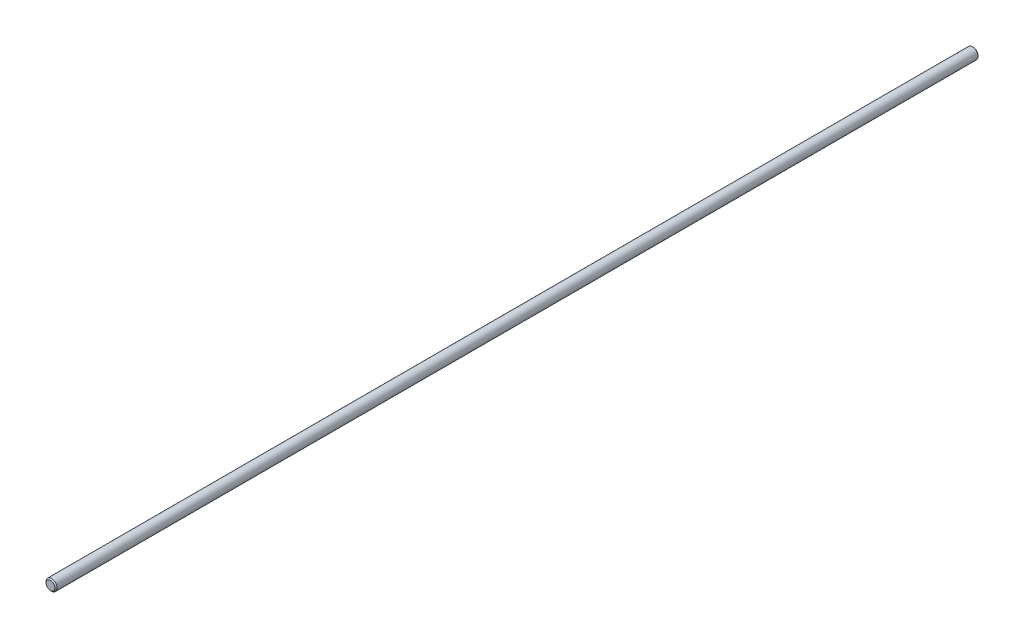
ISO-10303-21;
HEADER;
FILE_DESCRIPTION(('STEP AP214'),'2;1');
FILE_NAME('part.step','',(''),(''),'','','');
FILE_SCHEMA(('AUTOMOTIVE_DESIGN { 1 0 10303 214 1 1 1 1 }'));
ENDSEC;
DATA;
#1=APPLICATION_CONTEXT('core data for automotive mechanical design processes');
#2=APPLICATION_PROTOCOL_DEFINITION('international standard','automotive_design',2000,#1);
#3=PRODUCT_CONTEXT('',#1,'mechanical');
#4=PRODUCT('Part','Part','',(#3));
#5=PRODUCT_RELATED_PRODUCT_CATEGORY('part','',(#4));
#6=PRODUCT_DEFINITION_FORMATION('','',#4);
#7=PRODUCT_DEFINITION_CONTEXT('part definition',#1,'design');
#8=PRODUCT_DEFINITION('design','',#6,#7);
#9=PRODUCT_DEFINITION_SHAPE('','',#8);
#10=(LENGTH_UNIT() NAMED_UNIT(*) SI_UNIT(.MILLI.,.METRE.));
#11=(NAMED_UNIT(*) PLANE_ANGLE_UNIT() SI_UNIT($,.RADIAN.));
#12=(NAMED_UNIT(*) SI_UNIT($,.STERADIAN.) SOLID_ANGLE_UNIT());
#13=UNCERTAINTY_MEASURE_WITH_UNIT(LENGTH_MEASURE(1.E-05),#10,'distance_accuracy_value','');
#14=(GEOMETRIC_REPRESENTATION_CONTEXT(3) GLOBAL_UNCERTAINTY_ASSIGNED_CONTEXT((#13)) GLOBAL_UNIT_ASSIGNED_CONTEXT((#10,
#11,#12)) REPRESENTATION_CONTEXT('',''));
#15=CARTESIAN_POINT('',(0.,0.,0.));
#16=DIRECTION('',(0.,0.,1.));
#17=DIRECTION('',(1.,0.,0.));
#18=AXIS2_PLACEMENT_3D('',#15,#16,#17);
#19=CARTESIAN_POINT('',(0.,0.,500.));
#20=DIRECTION('',(0.,0.,-1.));
#21=DIRECTION('',(-1.,0.,0.));
#22=AXIS2_PLACEMENT_3D('',#19,#20,#21);
#23=CYLINDRICAL_SURFACE('',#22,3.);
#24=CARTESIAN_POINT('',(0.,0.,499.4));
#25=DIRECTION('',(0.,0.,1.));
#26=DIRECTION('',(1.,0.,0.));
#27=AXIS2_PLACEMENT_3D('',#24,#25,#26);
#28=CIRCLE('',#27,3.);
#29=CARTESIAN_POINT('',(3.,0.,499.4));
#30=VERTEX_POINT('',#29);
#31=EDGE_CURVE('E38',#30,#30,#28,.F.);
#32=ORIENTED_EDGE('',*,*,#31,.T.);
#33=EDGE_LOOP('',(#32));
#34=FACE_BOUND('',#33,.T.);
#35=CARTESIAN_POINT('',(0.,0.,0.600000000000045));
#36=DIRECTION('',(0.,0.,1.));
#37=DIRECTION('',(1.,0.,0.));
#38=AXIS2_PLACEMENT_3D('',#35,#36,#37);
#39=CIRCLE('',#38,3.);
#40=CARTESIAN_POINT('',(3.,0.,0.600000000000045));
#41=VERTEX_POINT('',#40);
#42=EDGE_CURVE('E42',#41,#41,#39,.T.);
#43=ORIENTED_EDGE('',*,*,#42,.T.);
#44=EDGE_LOOP('',(#43));
#45=FACE_BOUND('',#44,.T.);
#46=ADVANCED_FACE('F31',(#34,#45),#23,.T.);
#47=CARTESIAN_POINT('',(0.,0.,500.));
#48=DIRECTION('',(0.,0.,1.));
#49=DIRECTION('',(1.,0.,0.));
#50=AXIS2_PLACEMENT_3D('',#47,#48,#49);
#51=PLANE('',#50);
#52=CARTESIAN_POINT('',(0.,0.,500.));
#53=DIRECTION('',(0.,0.,1.));
#54=DIRECTION('',(1.,0.,0.));
#55=AXIS2_PLACEMENT_3D('',#52,#53,#54);
#56=CIRCLE('',#55,2.40000000000012);
#57=CARTESIAN_POINT('',(2.40000000000012,0.,500.));
#58=VERTEX_POINT('',#57);
#59=EDGE_CURVE('E46',#58,#58,#56,.T.);
#60=ORIENTED_EDGE('',*,*,#59,.T.);
#61=EDGE_LOOP('',(#60));
#62=FACE_BOUND('',#61,.T.);
#63=ADVANCED_FACE('F52',(#62),#51,.T.);
#64=CARTESIAN_POINT('',(0.,0.,0.));
#65=DIRECTION('',(0.,0.,1.));
#66=DIRECTION('',(1.,0.,0.));
#67=AXIS2_PLACEMENT_3D('',#64,#65,#66);
#68=PLANE('',#67);
#69=CARTESIAN_POINT('',(0.,0.,0.));
#70=DIRECTION('',(0.,0.,1.));
#71=DIRECTION('',(1.,0.,0.));
#72=AXIS2_PLACEMENT_3D('',#69,#70,#71);
#73=CIRCLE('',#72,2.39999999999996);
#74=CARTESIAN_POINT('',(2.39999999999996,0.,0.));
#75=VERTEX_POINT('',#74);
#76=EDGE_CURVE('E10',#75,#75,#73,.F.);
#77=ORIENTED_EDGE('',*,*,#76,.T.);
#78=EDGE_LOOP('',(#77));
#79=FACE_BOUND('',#78,.T.);
#80=ADVANCED_FACE('F56',(#79),#68,.F.);
#81=CARTESIAN_POINT('',(0.,0.,500.));
#82=DIRECTION('',(0.,0.,-1.));
#83=DIRECTION('',(-1.,0.,0.));
#84=AXIS2_PLACEMENT_3D('',#81,#82,#83);
#85=CONICAL_SURFACE('',#84,2.40000000000012,0.785398163397493);
#86=ORIENTED_EDGE('',*,*,#31,.F.);
#87=EDGE_LOOP('',(#86));
#88=FACE_BOUND('',#87,.T.);
#89=ORIENTED_EDGE('',*,*,#59,.F.);
#90=EDGE_LOOP('',(#89));
#91=FACE_BOUND('',#90,.T.);
#92=ADVANCED_FACE('F54',(#88,#91),#85,.T.);
#93=CARTESIAN_POINT('',(0.,0.,0.600000000000045));
#94=DIRECTION('',(0.,0.,1.));
#95=DIRECTION('',(1.,0.,0.));
#96=AXIS2_PLACEMENT_3D('',#93,#94,#95);
#97=CONICAL_SURFACE('',#96,3.,0.785398163397446);
#98=ORIENTED_EDGE('',*,*,#76,.F.);
#99=EDGE_LOOP('',(#98));
#100=FACE_BOUND('',#99,.T.);
#101=ORIENTED_EDGE('',*,*,#42,.F.);
#102=EDGE_LOOP('',(#101));
#103=FACE_BOUND('',#102,.T.);
#104=ADVANCED_FACE('F33',(#100,#103),#97,.T.);
#105=CLOSED_SHELL('',(#46,#63,#80,#92,#104));
#106=MANIFOLD_SOLID_BREP('B2',#105);
#107=ADVANCED_BREP_SHAPE_REPRESENTATION('',(#18,#106),#14);
#108=SHAPE_DEFINITION_REPRESENTATION(#9,#107);
ENDSEC;
END-ISO-10303-21;
